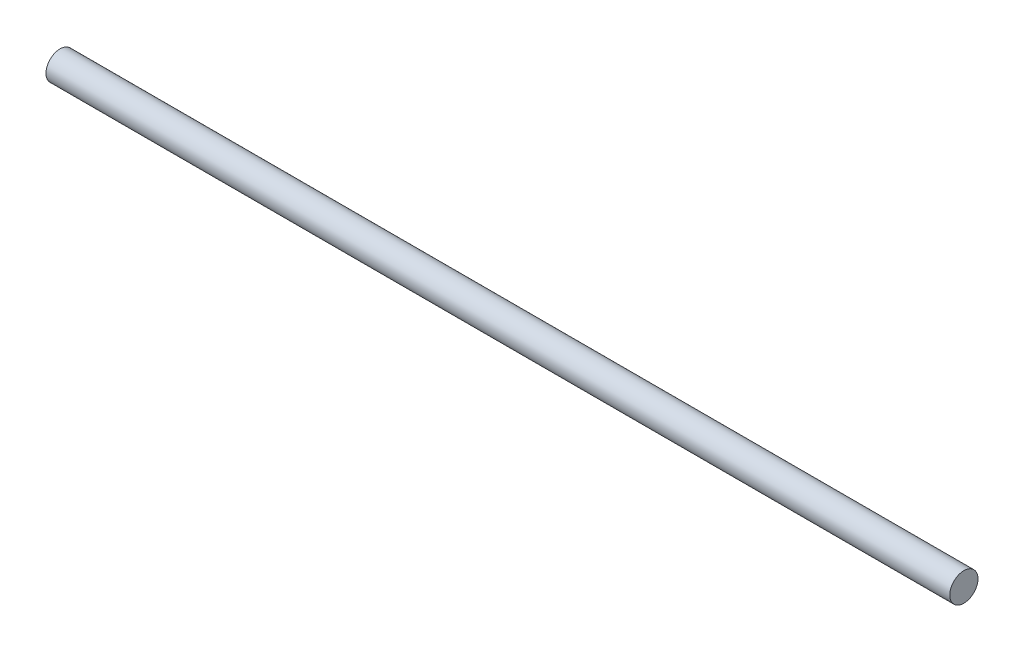
ISO-10303-21;
HEADER;
FILE_DESCRIPTION(('STEP AP214'),'2;1');
FILE_NAME('part.step','',(''),(''),'','','');
FILE_SCHEMA(('AUTOMOTIVE_DESIGN { 1 0 10303 214 1 1 1 1 }'));
ENDSEC;
DATA;
#1=APPLICATION_CONTEXT('core data for automotive mechanical design processes');
#2=APPLICATION_PROTOCOL_DEFINITION('international standard','automotive_design',2000,#1);
#3=PRODUCT_CONTEXT('',#1,'mechanical');
#4=PRODUCT('Part','Part','',(#3));
#5=PRODUCT_RELATED_PRODUCT_CATEGORY('part','',(#4));
#6=PRODUCT_DEFINITION_FORMATION('','',#4);
#7=PRODUCT_DEFINITION_CONTEXT('part definition',#1,'design');
#8=PRODUCT_DEFINITION('design','',#6,#7);
#9=PRODUCT_DEFINITION_SHAPE('','',#8);
#10=(LENGTH_UNIT() NAMED_UNIT(*) SI_UNIT(.MILLI.,.METRE.));
#11=(NAMED_UNIT(*) PLANE_ANGLE_UNIT() SI_UNIT($,.RADIAN.));
#12=(NAMED_UNIT(*) SI_UNIT($,.STERADIAN.) SOLID_ANGLE_UNIT());
#13=UNCERTAINTY_MEASURE_WITH_UNIT(LENGTH_MEASURE(1.E-05),#10,'distance_accuracy_value','');
#14=(GEOMETRIC_REPRESENTATION_CONTEXT(3) GLOBAL_UNCERTAINTY_ASSIGNED_CONTEXT((#13)) GLOBAL_UNIT_ASSIGNED_CONTEXT((#10,
#11,#12)) REPRESENTATION_CONTEXT('',''));
#15=CARTESIAN_POINT('',(0.,0.,0.));
#16=DIRECTION('',(0.,0.,1.));
#17=DIRECTION('',(1.,0.,0.));
#18=AXIS2_PLACEMENT_3D('',#15,#16,#17);
#19=CARTESIAN_POINT('',(254.,0.,0.));
#20=DIRECTION('',(-1.,0.,0.));
#21=DIRECTION('',(0.,0.,1.));
#22=AXIS2_PLACEMENT_3D('',#19,#20,#21);
#23=CYLINDRICAL_SURFACE('',#22,3.96875);
#24=CARTESIAN_POINT('',(254.,0.,0.));
#25=DIRECTION('',(1.,0.,0.));
#26=DIRECTION('',(0.,0.,-1.));
#27=AXIS2_PLACEMENT_3D('',#24,#25,#26);
#28=CIRCLE('',#27,3.96875);
#29=CARTESIAN_POINT('',(254.,0.,-3.96875));
#30=VERTEX_POINT('',#29);
#31=EDGE_CURVE('E10',#30,#30,#28,.T.);
#32=ORIENTED_EDGE('',*,*,#31,.F.);
#33=EDGE_LOOP('',(#32));
#34=FACE_BOUND('',#33,.T.);
#35=CARTESIAN_POINT('',(0.,0.,0.));
#36=DIRECTION('',(1.,0.,0.));
#37=DIRECTION('',(0.,0.,-1.));
#38=AXIS2_PLACEMENT_3D('',#35,#36,#37);
#39=CIRCLE('',#38,3.96875);
#40=CARTESIAN_POINT('',(0.,0.,-3.96875));
#41=VERTEX_POINT('',#40);
#42=EDGE_CURVE('E34',#41,#41,#39,.T.);
#43=ORIENTED_EDGE('',*,*,#42,.T.);
#44=EDGE_LOOP('',(#43));
#45=FACE_BOUND('',#44,.T.);
#46=ADVANCED_FACE('F31',(#34,#45),#23,.T.);
#47=CARTESIAN_POINT('',(254.,0.,0.));
#48=DIRECTION('',(1.,0.,0.));
#49=DIRECTION('',(0.,0.,-1.));
#50=AXIS2_PLACEMENT_3D('',#47,#48,#49);
#51=PLANE('',#50);
#52=ORIENTED_EDGE('',*,*,#31,.T.);
#53=EDGE_LOOP('',(#52));
#54=FACE_BOUND('',#53,.T.);
#55=ADVANCED_FACE('F46',(#54),#51,.T.);
#56=CARTESIAN_POINT('',(0.,0.,0.));
#57=DIRECTION('',(1.,0.,0.));
#58=DIRECTION('',(0.,0.,-1.));
#59=AXIS2_PLACEMENT_3D('',#56,#57,#58);
#60=PLANE('',#59);
#61=ORIENTED_EDGE('',*,*,#42,.F.);
#62=EDGE_LOOP('',(#61));
#63=FACE_BOUND('',#62,.T.);
#64=ADVANCED_FACE('F44',(#63),#60,.F.);
#65=CLOSED_SHELL('',(#46,#55,#64));
#66=MANIFOLD_SOLID_BREP('B2',#65);
#67=ADVANCED_BREP_SHAPE_REPRESENTATION('',(#18,#66),#14);
#68=SHAPE_DEFINITION_REPRESENTATION(#9,#67);
ENDSEC;
END-ISO-10303-21;
